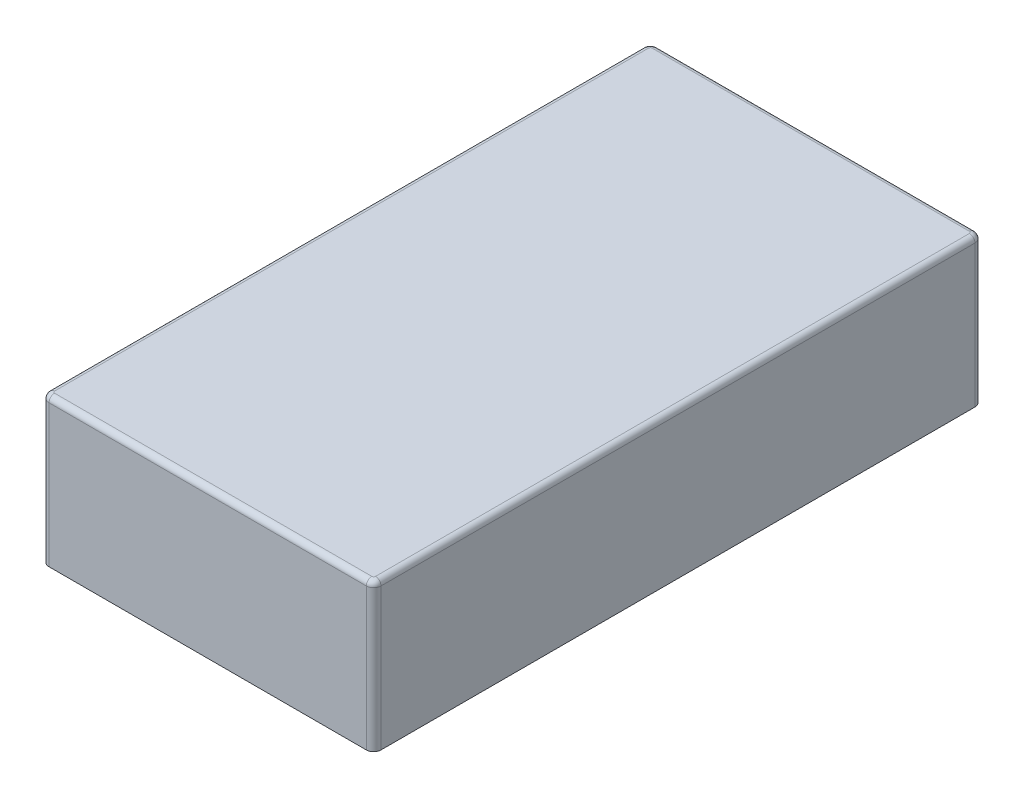
ISO-10303-21;
HEADER;
FILE_DESCRIPTION(('STEP AP214'),'2;1');
FILE_NAME('part.step','',(''),(''),'','','');
FILE_SCHEMA(('AUTOMOTIVE_DESIGN { 1 0 10303 214 1 1 1 1 }'));
ENDSEC;
DATA;
#1=APPLICATION_CONTEXT('core data for automotive mechanical design processes');
#2=APPLICATION_PROTOCOL_DEFINITION('international standard','automotive_design',2000,#1);
#3=PRODUCT_CONTEXT('',#1,'mechanical');
#4=PRODUCT('Part','Part','',(#3));
#5=PRODUCT_RELATED_PRODUCT_CATEGORY('part','',(#4));
#6=PRODUCT_DEFINITION_FORMATION('','',#4);
#7=PRODUCT_DEFINITION_CONTEXT('part definition',#1,'design');
#8=PRODUCT_DEFINITION('design','',#6,#7);
#9=PRODUCT_DEFINITION_SHAPE('','',#8);
#10=(LENGTH_UNIT() NAMED_UNIT(*) SI_UNIT(.MILLI.,.METRE.));
#11=(NAMED_UNIT(*) PLANE_ANGLE_UNIT() SI_UNIT($,.RADIAN.));
#12=(NAMED_UNIT(*) SI_UNIT($,.STERADIAN.) SOLID_ANGLE_UNIT());
#13=UNCERTAINTY_MEASURE_WITH_UNIT(LENGTH_MEASURE(1.E-05),#10,'distance_accuracy_value','');
#14=(GEOMETRIC_REPRESENTATION_CONTEXT(3) GLOBAL_UNCERTAINTY_ASSIGNED_CONTEXT((#13)) GLOBAL_UNIT_ASSIGNED_CONTEXT((#10,
#11,#12)) REPRESENTATION_CONTEXT('',''));
#15=CARTESIAN_POINT('',(0.,0.,0.));
#16=DIRECTION('',(0.,0.,1.));
#17=DIRECTION('',(1.,0.,0.));
#18=AXIS2_PLACEMENT_3D('',#15,#16,#17);
#19=CARTESIAN_POINT('',(0.,104.,0.));
#20=DIRECTION('',(0.,1.,0.));
#21=DIRECTION('',(0.,0.,1.));
#22=AXIS2_PLACEMENT_3D('',#19,#20,#21);
#23=PLANE('',#22);
#24=CARTESIAN_POINT('',(25.,104.,0.));
#25=DIRECTION('',(0.,-1.,0.));
#26=DIRECTION('',(0.,0.,-1.));
#27=AXIS2_PLACEMENT_3D('',#24,#25,#26);
#28=CIRCLE('',#27,3.2);
#29=CARTESIAN_POINT('',(25.,104.,-3.2));
#30=VERTEX_POINT('',#29);
#31=EDGE_CURVE('E522',#30,#30,#28,.T.);
#32=ORIENTED_EDGE('',*,*,#31,.F.);
#33=EDGE_LOOP('',(#32));
#34=FACE_BOUND('',#33,.T.);
#35=DIRECTION('',(0.,0.,-1.));
#36=VECTOR('',#35,1.);
#37=CARTESIAN_POINT('',(110.,104.,-77.9999925057749));
#38=LINE('',#37,#36);
#39=CARTESIAN_POINT('',(110.,104.,76.0000074942251));
#40=VERTEX_POINT('',#39);
#41=CARTESIAN_POINT('',(110.,104.,-75.9999925057749));
#42=VERTEX_POINT('',#41);
#43=EDGE_CURVE('E363',#40,#42,#38,.T.);
#44=ORIENTED_EDGE('',*,*,#43,.T.);
#45=CARTESIAN_POINT('',(108.,104.,-75.9999925057749));
#46=DIRECTION('',(0.,1.,0.));
#47=DIRECTION('',(0.,0.,1.));
#48=AXIS2_PLACEMENT_3D('',#45,#46,#47);
#49=CIRCLE('',#48,2.);
#50=CARTESIAN_POINT('',(108.,104.,-77.9999925057749));
#51=VERTEX_POINT('',#50);
#52=EDGE_CURVE('E360',#51,#42,#49,.F.);
#53=ORIENTED_EDGE('',*,*,#52,.F.);
#54=DIRECTION('',(-1.,0.,0.));
#55=VECTOR('',#54,1.);
#56=CARTESIAN_POINT('',(40.,104.,-77.9999925057749));
#57=LINE('',#56,#55);
#58=CARTESIAN_POINT('',(42.,104.,-77.9999925057749));
#59=VERTEX_POINT('',#58);
#60=EDGE_CURVE('E353',#51,#59,#57,.T.);
#61=ORIENTED_EDGE('',*,*,#60,.T.);
#62=CARTESIAN_POINT('',(42.,104.,-75.9999925057749));
#63=DIRECTION('',(0.,1.,0.));
#64=DIRECTION('',(0.,0.,1.));
#65=AXIS2_PLACEMENT_3D('',#62,#63,#64);
#66=CIRCLE('',#65,2.);
#67=CARTESIAN_POINT('',(40.,104.,-75.9999925057748));
#68=VERTEX_POINT('',#67);
#69=EDGE_CURVE('E427',#68,#59,#66,.F.);
#70=ORIENTED_EDGE('',*,*,#69,.F.);
#71=DIRECTION('',(0.,0.,1.));
#72=VECTOR('',#71,1.);
#73=CARTESIAN_POINT('',(40.0000000000004,104.,78.0000074942254));
#74=LINE('',#73,#72);
#75=CARTESIAN_POINT('',(40.0000000000004,104.,76.0000074942253));
#76=VERTEX_POINT('',#75);
#77=EDGE_CURVE('E355',#68,#76,#74,.T.);
#78=ORIENTED_EDGE('',*,*,#77,.T.);
#79=CARTESIAN_POINT('',(42.0000000000004,104.,76.0000074942253));
#80=DIRECTION('',(0.,1.,0.));
#81=DIRECTION('',(0.,0.,1.));
#82=AXIS2_PLACEMENT_3D('',#79,#80,#81);
#83=CIRCLE('',#82,2.);
#84=CARTESIAN_POINT('',(42.0000000000004,104.,78.0000074942254));
#85=VERTEX_POINT('',#84);
#86=EDGE_CURVE('E357',#85,#76,#83,.F.);
#87=ORIENTED_EDGE('',*,*,#86,.F.);
#88=DIRECTION('',(1.,0.,0.));
#89=VECTOR('',#88,1.);
#90=CARTESIAN_POINT('',(110.,104.,78.0000074942251));
#91=LINE('',#90,#89);
#92=CARTESIAN_POINT('',(108.,104.,78.0000074942251));
#93=VERTEX_POINT('',#92);
#94=EDGE_CURVE('E365',#85,#93,#91,.T.);
#95=ORIENTED_EDGE('',*,*,#94,.T.);
#96=CARTESIAN_POINT('',(108.,104.,76.0000074942251));
#97=DIRECTION('',(0.,1.,0.));
#98=DIRECTION('',(0.,0.,1.));
#99=AXIS2_PLACEMENT_3D('',#96,#97,#98);
#100=CIRCLE('',#99,2.);
#101=EDGE_CURVE('E325',#40,#93,#100,.F.);
#102=ORIENTED_EDGE('',*,*,#101,.F.);
#103=EDGE_LOOP('',(#44,#53,#61,#70,#78,#87,#95,#102));
#104=FACE_BOUND('',#103,.T.);
#105=DIRECTION('',(0.,0.,1.));
#106=VECTOR('',#105,1.);
#107=CARTESIAN_POINT('',(120.,104.,0.));
#108=LINE('',#107,#106);
#109=CARTESIAN_POINT('',(120.,104.,-80.5));
#110=VERTEX_POINT('',#109);
#111=CARTESIAN_POINT('',(120.,104.,80.5));
#112=VERTEX_POINT('',#111);
#113=EDGE_CURVE('E370',#110,#112,#108,.T.);
#114=ORIENTED_EDGE('',*,*,#113,.T.);
#115=CARTESIAN_POINT('',(118.,104.,80.5));
#116=DIRECTION('',(0.,1.,0.));
#117=DIRECTION('',(0.,0.,1.));
#118=AXIS2_PLACEMENT_3D('',#115,#116,#117);
#119=CIRCLE('',#118,2.);
#120=CARTESIAN_POINT('',(118.,104.,82.5));
#121=VERTEX_POINT('',#120);
#122=EDGE_CURVE('E375',#112,#121,#119,.F.);
#123=ORIENTED_EDGE('',*,*,#122,.T.);
#124=DIRECTION('',(1.,0.,0.));
#125=VECTOR('',#124,1.);
#126=CARTESIAN_POINT('',(-75.,104.,82.5));
#127=LINE('',#126,#125);
#128=CARTESIAN_POINT('',(32.,104.,82.5));
#129=VERTEX_POINT('',#128);
#130=EDGE_CURVE('E383',#129,#121,#127,.T.);
#131=ORIENTED_EDGE('',*,*,#130,.F.);
#132=CARTESIAN_POINT('',(32.,104.,80.5));
#133=DIRECTION('',(0.,1.,0.));
#134=DIRECTION('',(0.,0.,1.));
#135=AXIS2_PLACEMENT_3D('',#132,#133,#134);
#136=CIRCLE('',#135,2.);
#137=CARTESIAN_POINT('',(30.,104.,80.5));
#138=VERTEX_POINT('',#137);
#139=EDGE_CURVE('E386',#129,#138,#136,.F.);
#140=ORIENTED_EDGE('',*,*,#139,.T.);
#141=DIRECTION('',(0.,0.,1.));
#142=VECTOR('',#141,1.);
#143=CARTESIAN_POINT('',(30.,104.,82.5));
#144=LINE('',#143,#142);
#145=CARTESIAN_POINT('',(30.,104.,6.50000000000001));
#146=VERTEX_POINT('',#145);
#147=EDGE_CURVE('E379',#146,#138,#144,.T.);
#148=ORIENTED_EDGE('',*,*,#147,.F.);
#149=CARTESIAN_POINT('',(28.5,104.,6.50000000000001));
#150=DIRECTION('',(0.,1.,0.));
#151=DIRECTION('',(0.,0.,1.));
#152=AXIS2_PLACEMENT_3D('',#149,#150,#151);
#153=CIRCLE('',#152,1.5);
#154=CARTESIAN_POINT('',(28.5,104.,5.));
#155=VERTEX_POINT('',#154);
#156=EDGE_CURVE('E132',#146,#155,#153,.T.);
#157=ORIENTED_EDGE('',*,*,#156,.T.);
#158=DIRECTION('',(1.,0.,0.));
#159=VECTOR('',#158,1.);
#160=CARTESIAN_POINT('',(0.,104.,5.));
#161=LINE('',#160,#159);
#162=CARTESIAN_POINT('',(21.5,104.,5.));
#163=VERTEX_POINT('',#162);
#164=EDGE_CURVE('E696',#163,#155,#161,.T.);
#165=ORIENTED_EDGE('',*,*,#164,.F.);
#166=CARTESIAN_POINT('',(21.5,104.,3.5));
#167=DIRECTION('',(0.,1.,0.));
#168=DIRECTION('',(0.,0.,1.));
#169=AXIS2_PLACEMENT_3D('',#166,#167,#168);
#170=CIRCLE('',#169,1.5);
#171=CARTESIAN_POINT('',(20.,104.,3.5));
#172=VERTEX_POINT('',#171);
#173=EDGE_CURVE('E505',#163,#172,#170,.F.);
#174=ORIENTED_EDGE('',*,*,#173,.T.);
#175=DIRECTION('',(0.,0.,-1.));
#176=VECTOR('',#175,1.);
#177=CARTESIAN_POINT('',(20.,104.,0.));
#178=LINE('',#177,#176);
#179=CARTESIAN_POINT('',(20.,104.,-3.5));
#180=VERTEX_POINT('',#179);
#181=EDGE_CURVE('E693',#172,#180,#178,.T.);
#182=ORIENTED_EDGE('',*,*,#181,.T.);
#183=CARTESIAN_POINT('',(21.5,104.,-3.5));
#184=DIRECTION('',(0.,1.,0.));
#185=DIRECTION('',(0.,0.,1.));
#186=AXIS2_PLACEMENT_3D('',#183,#184,#185);
#187=CIRCLE('',#186,1.5);
#188=CARTESIAN_POINT('',(21.5,104.,-5.));
#189=VERTEX_POINT('',#188);
#190=EDGE_CURVE('E147',#180,#189,#187,.F.);
#191=ORIENTED_EDGE('',*,*,#190,.T.);
#192=DIRECTION('',(1.,0.,0.));
#193=VECTOR('',#192,1.);
#194=CARTESIAN_POINT('',(0.,104.,-5.));
#195=LINE('',#194,#193);
#196=CARTESIAN_POINT('',(28.5,104.,-5.));
#197=VERTEX_POINT('',#196);
#198=EDGE_CURVE('E695',#189,#197,#195,.T.);
#199=ORIENTED_EDGE('',*,*,#198,.T.);
#200=CARTESIAN_POINT('',(28.5,104.,-6.5));
#201=DIRECTION('',(0.,1.,0.));
#202=DIRECTION('',(0.,0.,1.));
#203=AXIS2_PLACEMENT_3D('',#200,#201,#202);
#204=CIRCLE('',#203,1.5);
#205=CARTESIAN_POINT('',(30.,104.,-6.49999999999999));
#206=VERTEX_POINT('',#205);
#207=EDGE_CURVE('E12',#197,#206,#204,.T.);
#208=ORIENTED_EDGE('',*,*,#207,.T.);
#209=CARTESIAN_POINT('',(30.,104.,-80.5));
#210=VERTEX_POINT('',#209);
#211=EDGE_CURVE('E380',#210,#206,#144,.T.);
#212=ORIENTED_EDGE('',*,*,#211,.F.);
#213=CARTESIAN_POINT('',(32.,104.,-80.5));
#214=DIRECTION('',(0.,1.,0.));
#215=DIRECTION('',(0.,0.,1.));
#216=AXIS2_PLACEMENT_3D('',#213,#214,#215);
#217=CIRCLE('',#216,2.);
#218=CARTESIAN_POINT('',(32.,104.,-82.5));
#219=VERTEX_POINT('',#218);
#220=EDGE_CURVE('E377',#210,#219,#217,.F.);
#221=ORIENTED_EDGE('',*,*,#220,.T.);
#222=DIRECTION('',(-1.,0.,0.));
#223=VECTOR('',#222,1.);
#224=CARTESIAN_POINT('',(-75.,104.,-82.5));
#225=LINE('',#224,#223);
#226=CARTESIAN_POINT('',(118.,104.,-82.5));
#227=VERTEX_POINT('',#226);
#228=EDGE_CURVE('E372',#227,#219,#225,.T.);
#229=ORIENTED_EDGE('',*,*,#228,.F.);
#230=CARTESIAN_POINT('',(118.,104.,-80.5));
#231=DIRECTION('',(0.,1.,0.));
#232=DIRECTION('',(0.,0.,1.));
#233=AXIS2_PLACEMENT_3D('',#230,#231,#232);
#234=CIRCLE('',#233,2.);
#235=EDGE_CURVE('E368',#227,#110,#234,.F.);
#236=ORIENTED_EDGE('',*,*,#235,.T.);
#237=EDGE_LOOP('',(#114,#123,#131,#140,#148,#157,#165,#174,#182,#191,#199,#208,#212,#221,#229,#236));
#238=FACE_BOUND('',#237,.T.);
#239=ADVANCED_FACE('F123',(#34,#104,#238),#23,.F.);
#240=CARTESIAN_POINT('',(30.,107.,82.5));
#241=DIRECTION('',(1.,0.,0.));
#242=DIRECTION('',(0.,0.,-1.));
#243=AXIS2_PLACEMENT_3D('',#240,#241,#242);
#244=PLANE('',#243);
#245=CARTESIAN_POINT('',(30.,131.307025548532,0.));
#246=DIRECTION('',(-1.,0.,0.));
#247=DIRECTION('',(0.,0.,1.));
#248=AXIS2_PLACEMENT_3D('',#245,#246,#247);
#249=ELLIPSE('',#248,10.5630271411605,4.77851227814405);
#250=CARTESIAN_POINT('',(30.,131.307025548532,10.5630271411605));
#251=VERTEX_POINT('',#250);
#252=EDGE_CURVE('E524',#251,#251,#249,.T.);
#253=ORIENTED_EDGE('',*,*,#252,.F.);
#254=EDGE_LOOP('',(#253));
#255=FACE_BOUND('',#254,.T.);
#256=DIRECTION('',(0.,0.,-1.));
#257=VECTOR('',#256,1.);
#258=CARTESIAN_POINT('',(30.,110.5,5.));
#259=LINE('',#258,#257);
#260=CARTESIAN_POINT('',(30.,110.5,-6.5));
#261=VERTEX_POINT('',#260);
#262=CARTESIAN_POINT('',(30.,110.5,6.50000000000001));
#263=VERTEX_POINT('',#262);
#264=EDGE_CURVE('E495',#261,#263,#259,.F.);
#265=ORIENTED_EDGE('',*,*,#264,.T.);
#266=DIRECTION('',(0.,-1.,0.));
#267=VECTOR('',#266,1.);
#268=CARTESIAN_POINT('',(30.,104.,6.50000000000001));
#269=LINE('',#268,#267);
#270=EDGE_CURVE('E497',#263,#146,#269,.T.);
#271=ORIENTED_EDGE('',*,*,#270,.T.);
#272=ORIENTED_EDGE('',*,*,#147,.T.);
#273=DIRECTION('',(0.,-1.,0.));
#274=VECTOR('',#273,1.);
#275=CARTESIAN_POINT('',(30.,107.,80.5));
#276=LINE('',#275,#274);
#277=CARTESIAN_POINT('',(30.,142.5,80.5));
#278=VERTEX_POINT('',#277);
#279=EDGE_CURVE('E389',#138,#278,#276,.F.);
#280=ORIENTED_EDGE('',*,*,#279,.T.);
#281=DIRECTION('',(0.,0.,1.));
#282=VECTOR('',#281,1.);
#283=CARTESIAN_POINT('',(30.,142.5,-80.5));
#284=LINE('',#283,#282);
#285=CARTESIAN_POINT('',(30.,142.5,-80.5));
#286=VERTEX_POINT('',#285);
#287=EDGE_CURVE('E447',#278,#286,#284,.F.);
#288=ORIENTED_EDGE('',*,*,#287,.T.);
#289=DIRECTION('',(0.,-1.,0.));
#290=VECTOR('',#289,1.);
#291=CARTESIAN_POINT('',(30.,107.,-80.5));
#292=LINE('',#291,#290);
#293=EDGE_CURVE('E392',#286,#210,#292,.T.);
#294=ORIENTED_EDGE('',*,*,#293,.T.);
#295=ORIENTED_EDGE('',*,*,#211,.T.);
#296=DIRECTION('',(0.,-1.,0.));
#297=VECTOR('',#296,1.);
#298=CARTESIAN_POINT('',(30.,107.,-6.49999999999999));
#299=LINE('',#298,#297);
#300=EDGE_CURVE('E493',#206,#261,#299,.F.);
#301=ORIENTED_EDGE('',*,*,#300,.T.);
#302=EDGE_LOOP('',(#265,#271,#272,#280,#288,#294,#295,#301));
#303=FACE_BOUND('',#302,.T.);
#304=ADVANCED_FACE('F568',(#255,#303),#244,.F.);
#305=CARTESIAN_POINT('',(-75.,12.,82.5));
#306=DIRECTION('',(0.,0.,-1.));
#307=DIRECTION('',(-1.,0.,0.));
#308=AXIS2_PLACEMENT_3D('',#305,#306,#307);
#309=PLANE('',#308);
#310=DIRECTION('',(0.,1.,0.));
#311=VECTOR('',#310,1.);
#312=CARTESIAN_POINT('',(118.,107.,82.5));
#313=LINE('',#312,#311);
#314=CARTESIAN_POINT('',(118.,142.5,82.5));
#315=VERTEX_POINT('',#314);
#316=EDGE_CURVE('E399',#121,#315,#313,.T.);
#317=ORIENTED_EDGE('',*,*,#316,.T.);
#318=DIRECTION('',(1.,0.,0.));
#319=VECTOR('',#318,1.);
#320=CARTESIAN_POINT('',(32.,142.5,82.5));
#321=LINE('',#320,#319);
#322=CARTESIAN_POINT('',(32.,142.5,82.5));
#323=VERTEX_POINT('',#322);
#324=EDGE_CURVE('E460',#315,#323,#321,.F.);
#325=ORIENTED_EDGE('',*,*,#324,.T.);
#326=DIRECTION('',(0.,-1.,0.));
#327=VECTOR('',#326,1.);
#328=CARTESIAN_POINT('',(32.,12.,82.5));
#329=LINE('',#328,#327);
#330=EDGE_CURVE('E397',#323,#129,#329,.T.);
#331=ORIENTED_EDGE('',*,*,#330,.T.);
#332=ORIENTED_EDGE('',*,*,#130,.T.);
#333=EDGE_LOOP('',(#317,#325,#331,#332));
#334=FACE_BOUND('',#333,.T.);
#335=ADVANCED_FACE('F587',(#334),#309,.F.);
#336=CARTESIAN_POINT('',(-75.,12.,-82.5));
#337=DIRECTION('',(0.,0.,1.));
#338=DIRECTION('',(1.,0.,0.));
#339=AXIS2_PLACEMENT_3D('',#336,#337,#338);
#340=PLANE('',#339);
#341=DIRECTION('',(0.,-1.,0.));
#342=VECTOR('',#341,1.);
#343=CARTESIAN_POINT('',(32.,12.,-82.5));
#344=LINE('',#343,#342);
#345=CARTESIAN_POINT('',(32.,142.5,-82.5));
#346=VERTEX_POINT('',#345);
#347=EDGE_CURVE('E394',#219,#346,#344,.F.);
#348=ORIENTED_EDGE('',*,*,#347,.T.);
#349=DIRECTION('',(-1.,0.,0.));
#350=VECTOR('',#349,1.);
#351=CARTESIAN_POINT('',(118.,142.5,-82.5));
#352=LINE('',#351,#350);
#353=CARTESIAN_POINT('',(118.,142.5,-82.5));
#354=VERTEX_POINT('',#353);
#355=EDGE_CURVE('E452',#346,#354,#352,.F.);
#356=ORIENTED_EDGE('',*,*,#355,.T.);
#357=DIRECTION('',(0.,1.,0.));
#358=VECTOR('',#357,1.);
#359=CARTESIAN_POINT('',(118.,0.,-82.5));
#360=LINE('',#359,#358);
#361=EDGE_CURVE('E408',#354,#227,#360,.F.);
#362=ORIENTED_EDGE('',*,*,#361,.T.);
#363=ORIENTED_EDGE('',*,*,#228,.T.);
#364=EDGE_LOOP('',(#348,#356,#362,#363));
#365=FACE_BOUND('',#364,.T.);
#366=ADVANCED_FACE('F591',(#365),#340,.F.);
#367=CARTESIAN_POINT('',(120.,-171.026313764871,0.));
#368=DIRECTION('',(1.,0.,0.));
#369=DIRECTION('',(0.,0.,-1.));
#370=AXIS2_PLACEMENT_3D('',#367,#368,#369);
#371=PLANE('',#370);
#372=DIRECTION('',(0.,1.,0.));
#373=VECTOR('',#372,1.);
#374=CARTESIAN_POINT('',(120.,0.,80.5));
#375=LINE('',#374,#373);
#376=CARTESIAN_POINT('',(120.,142.5,80.5));
#377=VERTEX_POINT('',#376);
#378=EDGE_CURVE('E405',#377,#112,#375,.F.);
#379=ORIENTED_EDGE('',*,*,#378,.T.);
#380=ORIENTED_EDGE('',*,*,#113,.F.);
#381=DIRECTION('',(0.,1.,0.));
#382=VECTOR('',#381,1.);
#383=CARTESIAN_POINT('',(120.,107.,-80.5));
#384=LINE('',#383,#382);
#385=CARTESIAN_POINT('',(120.,142.5,-80.5));
#386=VERTEX_POINT('',#385);
#387=EDGE_CURVE('E402',#110,#386,#384,.T.);
#388=ORIENTED_EDGE('',*,*,#387,.T.);
#389=DIRECTION('',(0.,0.,-1.));
#390=VECTOR('',#389,1.);
#391=CARTESIAN_POINT('',(120.,142.5,0.));
#392=LINE('',#391,#390);
#393=EDGE_CURVE('E456',#386,#377,#392,.F.);
#394=ORIENTED_EDGE('',*,*,#393,.T.);
#395=EDGE_LOOP('',(#379,#380,#388,#394));
#396=FACE_BOUND('',#395,.T.);
#397=ADVANCED_FACE('F584',(#396),#371,.T.);
#398=CARTESIAN_POINT('',(40.0000000000004,107.,78.0000074942254));
#399=DIRECTION('',(1.,0.,0.));
#400=DIRECTION('',(0.,0.,-1.));
#401=AXIS2_PLACEMENT_3D('',#398,#399,#400);
#402=PLANE('',#401);
#403=CARTESIAN_POINT('',(40.,131.307025548532,0.));
#404=DIRECTION('',(-1.,0.,0.));
#405=DIRECTION('',(0.,0.,1.));
#406=AXIS2_PLACEMENT_3D('',#403,#404,#405);
#407=ELLIPSE('',#406,10.5630271411605,4.77851227814405);
#408=CARTESIAN_POINT('',(40.,131.307025548532,10.5630271411605));
#409=VERTEX_POINT('',#408);
#410=EDGE_CURVE('E516',#409,#409,#407,.T.);
#411=ORIENTED_EDGE('',*,*,#410,.T.);
#412=EDGE_LOOP('',(#411));
#413=FACE_BOUND('',#412,.T.);
#414=ORIENTED_EDGE('',*,*,#77,.F.);
#415=DIRECTION('',(0.,-1.,0.));
#416=VECTOR('',#415,1.);
#417=CARTESIAN_POINT('',(40.,107.,-75.9999925057749));
#418=LINE('',#417,#416);
#419=CARTESIAN_POINT('',(40.,139.,-75.9999925057748));
#420=VERTEX_POINT('',#419);
#421=EDGE_CURVE('E421',#68,#420,#418,.F.);
#422=ORIENTED_EDGE('',*,*,#421,.T.);
#423=DIRECTION('',(0.,0.,1.));
#424=VECTOR('',#423,1.);
#425=CARTESIAN_POINT('',(40.,139.,-75.9999925057748));
#426=LINE('',#425,#424);
#427=CARTESIAN_POINT('',(40.0000000000004,139.,76.0000074942253));
#428=VERTEX_POINT('',#427);
#429=EDGE_CURVE('E350',#420,#428,#426,.T.);
#430=ORIENTED_EDGE('',*,*,#429,.T.);
#431=DIRECTION('',(0.,-1.,0.));
#432=VECTOR('',#431,1.);
#433=CARTESIAN_POINT('',(40.0000000000004,12.,76.0000074942253));
#434=LINE('',#433,#432);
#435=EDGE_CURVE('E424',#428,#76,#434,.T.);
#436=ORIENTED_EDGE('',*,*,#435,.T.);
#437=EDGE_LOOP('',(#414,#422,#430,#436));
#438=FACE_BOUND('',#437,.T.);
#439=ADVANCED_FACE('F581',(#413,#438),#402,.T.);
#440=CARTESIAN_POINT('',(110.,107.,78.0000074942251));
#441=DIRECTION('',(0.,0.,-1.));
#442=DIRECTION('',(-1.,0.,0.));
#443=AXIS2_PLACEMENT_3D('',#440,#441,#442);
#444=PLANE('',#443);
#445=ORIENTED_EDGE('',*,*,#94,.F.);
#446=DIRECTION('',(0.,-1.,0.));
#447=VECTOR('',#446,1.);
#448=CARTESIAN_POINT('',(42.0000000000004,107.,78.0000074942254));
#449=LINE('',#448,#447);
#450=CARTESIAN_POINT('',(42.0000000000004,139.,78.0000074942254));
#451=VERTEX_POINT('',#450);
#452=EDGE_CURVE('E329',#85,#451,#449,.F.);
#453=ORIENTED_EDGE('',*,*,#452,.T.);
#454=DIRECTION('',(1.,0.,0.));
#455=VECTOR('',#454,1.);
#456=CARTESIAN_POINT('',(42.0000000000004,139.,78.0000074942254));
#457=LINE('',#456,#455);
#458=CARTESIAN_POINT('',(108.,139.,78.0000074942251));
#459=VERTEX_POINT('',#458);
#460=EDGE_CURVE('E313',#451,#459,#457,.T.);
#461=ORIENTED_EDGE('',*,*,#460,.T.);
#462=DIRECTION('',(0.,-1.,0.));
#463=VECTOR('',#462,1.);
#464=CARTESIAN_POINT('',(108.,12.,78.0000074942251));
#465=LINE('',#464,#463);
#466=EDGE_CURVE('E323',#459,#93,#465,.T.);
#467=ORIENTED_EDGE('',*,*,#466,.T.);
#468=EDGE_LOOP('',(#445,#453,#461,#467));
#469=FACE_BOUND('',#468,.T.);
#470=ADVANCED_FACE('F331',(#469),#444,.T.);
#471=CARTESIAN_POINT('',(110.,107.,-77.9999925057749));
#472=DIRECTION('',(-1.,0.,0.));
#473=DIRECTION('',(0.,0.,1.));
#474=AXIS2_PLACEMENT_3D('',#471,#472,#473);
#475=PLANE('',#474);
#476=ORIENTED_EDGE('',*,*,#43,.F.);
#477=DIRECTION('',(0.,-1.,0.));
#478=VECTOR('',#477,1.);
#479=CARTESIAN_POINT('',(110.,107.,76.0000074942251));
#480=LINE('',#479,#478);
#481=CARTESIAN_POINT('',(110.,139.,76.0000074942251));
#482=VERTEX_POINT('',#481);
#483=EDGE_CURVE('E413',#40,#482,#480,.F.);
#484=ORIENTED_EDGE('',*,*,#483,.T.);
#485=DIRECTION('',(0.,0.,-1.));
#486=VECTOR('',#485,1.);
#487=CARTESIAN_POINT('',(110.,139.,76.0000074942251));
#488=LINE('',#487,#486);
#489=CARTESIAN_POINT('',(110.,139.,-75.9999925057749));
#490=VERTEX_POINT('',#489);
#491=EDGE_CURVE('E316',#482,#490,#488,.T.);
#492=ORIENTED_EDGE('',*,*,#491,.T.);
#493=DIRECTION('',(0.,-1.,0.));
#494=VECTOR('',#493,1.);
#495=CARTESIAN_POINT('',(110.,12.,-75.9999925057749));
#496=LINE('',#495,#494);
#497=EDGE_CURVE('E328',#490,#42,#496,.T.);
#498=ORIENTED_EDGE('',*,*,#497,.T.);
#499=EDGE_LOOP('',(#476,#484,#492,#498));
#500=FACE_BOUND('',#499,.T.);
#501=ADVANCED_FACE('F574',(#500),#475,.T.);
#502=CARTESIAN_POINT('',(40.,107.,-77.9999925057749));
#503=DIRECTION('',(0.,0.,1.));
#504=DIRECTION('',(1.,0.,0.));
#505=AXIS2_PLACEMENT_3D('',#502,#503,#504);
#506=PLANE('',#505);
#507=ORIENTED_EDGE('',*,*,#60,.F.);
#508=DIRECTION('',(0.,-1.,0.));
#509=VECTOR('',#508,1.);
#510=CARTESIAN_POINT('',(108.,107.,-77.9999925057749));
#511=LINE('',#510,#509);
#512=CARTESIAN_POINT('',(108.,139.,-77.9999925057749));
#513=VERTEX_POINT('',#512);
#514=EDGE_CURVE('E418',#51,#513,#511,.F.);
#515=ORIENTED_EDGE('',*,*,#514,.T.);
#516=DIRECTION('',(-1.,0.,0.));
#517=VECTOR('',#516,1.);
#518=CARTESIAN_POINT('',(108.,139.,-77.9999925057749));
#519=LINE('',#518,#517);
#520=CARTESIAN_POINT('',(42.,139.,-77.9999925057749));
#521=VERTEX_POINT('',#520);
#522=EDGE_CURVE('E344',#513,#521,#519,.T.);
#523=ORIENTED_EDGE('',*,*,#522,.T.);
#524=DIRECTION('',(0.,-1.,0.));
#525=VECTOR('',#524,1.);
#526=CARTESIAN_POINT('',(42.,12.,-77.9999925057749));
#527=LINE('',#526,#525);
#528=EDGE_CURVE('E415',#521,#59,#527,.T.);
#529=ORIENTED_EDGE('',*,*,#528,.T.);
#530=EDGE_LOOP('',(#507,#515,#523,#529));
#531=FACE_BOUND('',#530,.T.);
#532=ADVANCED_FACE('F570',(#531),#506,.T.);
#533=CARTESIAN_POINT('',(32.,12.,80.5));
#534=DIRECTION('',(0.,-1.,0.));
#535=DIRECTION('',(0.,0.,-1.));
#536=AXIS2_PLACEMENT_3D('',#533,#534,#535);
#537=CYLINDRICAL_SURFACE('',#536,2.);
#538=ORIENTED_EDGE('',*,*,#330,.F.);
#539=CARTESIAN_POINT('',(32.,142.5,80.5));
#540=DIRECTION('',(0.,1.,0.));
#541=DIRECTION('',(0.,0.,1.));
#542=AXIS2_PLACEMENT_3D('',#539,#540,#541);
#543=CIRCLE('',#542,2.);
#544=EDGE_CURVE('E462',#323,#278,#543,.F.);
#545=ORIENTED_EDGE('',*,*,#544,.T.);
#546=ORIENTED_EDGE('',*,*,#279,.F.);
#547=ORIENTED_EDGE('',*,*,#139,.F.);
#548=EDGE_LOOP('',(#538,#545,#546,#547));
#549=FACE_BOUND('',#548,.T.);
#550=ADVANCED_FACE('F573',(#549),#537,.T.);
#551=CARTESIAN_POINT('',(32.,107.,-80.5));
#552=DIRECTION('',(0.,-1.,0.));
#553=DIRECTION('',(0.,0.,-1.));
#554=AXIS2_PLACEMENT_3D('',#551,#552,#553);
#555=CYLINDRICAL_SURFACE('',#554,2.);
#556=ORIENTED_EDGE('',*,*,#293,.F.);
#557=CARTESIAN_POINT('',(32.,142.5,-80.5));
#558=DIRECTION('',(0.,1.,0.));
#559=DIRECTION('',(0.,0.,1.));
#560=AXIS2_PLACEMENT_3D('',#557,#558,#559);
#561=CIRCLE('',#560,2.);
#562=EDGE_CURVE('E450',#286,#346,#561,.F.);
#563=ORIENTED_EDGE('',*,*,#562,.T.);
#564=ORIENTED_EDGE('',*,*,#347,.F.);
#565=ORIENTED_EDGE('',*,*,#220,.F.);
#566=EDGE_LOOP('',(#556,#563,#564,#565));
#567=FACE_BOUND('',#566,.T.);
#568=ADVANCED_FACE('F599',(#567),#555,.T.);
#569=CARTESIAN_POINT('',(118.,12.,80.5));
#570=DIRECTION('',(0.,-1.,0.));
#571=DIRECTION('',(0.,0.,-1.));
#572=AXIS2_PLACEMENT_3D('',#569,#570,#571);
#573=CYLINDRICAL_SURFACE('',#572,2.);
#574=ORIENTED_EDGE('',*,*,#378,.F.);
#575=CARTESIAN_POINT('',(118.,142.5,80.5));
#576=DIRECTION('',(0.,1.,0.));
#577=DIRECTION('',(0.,0.,1.));
#578=AXIS2_PLACEMENT_3D('',#575,#576,#577);
#579=CIRCLE('',#578,2.);
#580=EDGE_CURVE('E458',#377,#315,#579,.F.);
#581=ORIENTED_EDGE('',*,*,#580,.T.);
#582=ORIENTED_EDGE('',*,*,#316,.F.);
#583=ORIENTED_EDGE('',*,*,#122,.F.);
#584=EDGE_LOOP('',(#574,#581,#582,#583));
#585=FACE_BOUND('',#584,.T.);
#586=ADVANCED_FACE('F602',(#585),#573,.T.);
#587=CARTESIAN_POINT('',(118.,-171.026313764871,-80.5));
#588=DIRECTION('',(0.,-1.,0.));
#589=DIRECTION('',(0.,0.,-1.));
#590=AXIS2_PLACEMENT_3D('',#587,#588,#589);
#591=CYLINDRICAL_SURFACE('',#590,2.);
#592=ORIENTED_EDGE('',*,*,#361,.F.);
#593=CARTESIAN_POINT('',(118.,142.5,-80.5));
#594=DIRECTION('',(0.,1.,0.));
#595=DIRECTION('',(0.,0.,1.));
#596=AXIS2_PLACEMENT_3D('',#593,#594,#595);
#597=CIRCLE('',#596,2.);
#598=EDGE_CURVE('E454',#354,#386,#597,.F.);
#599=ORIENTED_EDGE('',*,*,#598,.T.);
#600=ORIENTED_EDGE('',*,*,#387,.F.);
#601=ORIENTED_EDGE('',*,*,#235,.F.);
#602=EDGE_LOOP('',(#592,#599,#600,#601));
#603=FACE_BOUND('',#602,.T.);
#604=ADVANCED_FACE('F609',(#603),#591,.T.);
#605=CARTESIAN_POINT('',(108.,107.,76.0000074942251));
#606=DIRECTION('',(0.,1.,0.));
#607=DIRECTION('',(0.,0.,1.));
#608=AXIS2_PLACEMENT_3D('',#605,#606,#607);
#609=CYLINDRICAL_SURFACE('',#608,2.);
#610=ORIENTED_EDGE('',*,*,#483,.F.);
#611=ORIENTED_EDGE('',*,*,#101,.T.);
#612=ORIENTED_EDGE('',*,*,#466,.F.);
#613=CARTESIAN_POINT('',(108.,139.,76.0000074942251));
#614=DIRECTION('',(0.,1.,0.));
#615=DIRECTION('',(0.,0.,1.));
#616=AXIS2_PLACEMENT_3D('',#613,#614,#615);
#617=CIRCLE('',#616,2.);
#618=EDGE_CURVE('E309',#459,#482,#617,.T.);
#619=ORIENTED_EDGE('',*,*,#618,.T.);
#620=EDGE_LOOP('',(#610,#611,#612,#619));
#621=FACE_BOUND('',#620,.T.);
#622=ADVANCED_FACE('F324',(#621),#609,.F.);
#623=CARTESIAN_POINT('',(108.,107.,-75.9999925057749));
#624=DIRECTION('',(0.,1.,0.));
#625=DIRECTION('',(0.,0.,1.));
#626=AXIS2_PLACEMENT_3D('',#623,#624,#625);
#627=CYLINDRICAL_SURFACE('',#626,2.);
#628=ORIENTED_EDGE('',*,*,#514,.F.);
#629=ORIENTED_EDGE('',*,*,#52,.T.);
#630=ORIENTED_EDGE('',*,*,#497,.F.);
#631=CARTESIAN_POINT('',(108.,139.,-75.9999925057749));
#632=DIRECTION('',(0.,1.,0.));
#633=DIRECTION('',(0.,0.,1.));
#634=AXIS2_PLACEMENT_3D('',#631,#632,#633);
#635=CIRCLE('',#634,2.);
#636=EDGE_CURVE('E341',#490,#513,#635,.T.);
#637=ORIENTED_EDGE('',*,*,#636,.T.);
#638=EDGE_LOOP('',(#628,#629,#630,#637));
#639=FACE_BOUND('',#638,.T.);
#640=ADVANCED_FACE('F616',(#639),#627,.F.);
#641=CARTESIAN_POINT('',(42.0000000000004,107.,76.0000074942253));
#642=DIRECTION('',(0.,1.,0.));
#643=DIRECTION('',(0.,0.,1.));
#644=AXIS2_PLACEMENT_3D('',#641,#642,#643);
#645=CYLINDRICAL_SURFACE('',#644,2.);
#646=ORIENTED_EDGE('',*,*,#452,.F.);
#647=ORIENTED_EDGE('',*,*,#86,.T.);
#648=ORIENTED_EDGE('',*,*,#435,.F.);
#649=CARTESIAN_POINT('',(42.0000000000004,139.,76.0000074942253));
#650=DIRECTION('',(0.,1.,0.));
#651=DIRECTION('',(0.,0.,1.));
#652=AXIS2_PLACEMENT_3D('',#649,#650,#651);
#653=CIRCLE('',#652,2.);
#654=EDGE_CURVE('E334',#428,#451,#653,.T.);
#655=ORIENTED_EDGE('',*,*,#654,.T.);
#656=EDGE_LOOP('',(#646,#647,#648,#655));
#657=FACE_BOUND('',#656,.T.);
#658=ADVANCED_FACE('F619',(#657),#645,.F.);
#659=CARTESIAN_POINT('',(42.,107.,-75.9999925057749));
#660=DIRECTION('',(0.,1.,0.));
#661=DIRECTION('',(0.,0.,1.));
#662=AXIS2_PLACEMENT_3D('',#659,#660,#661);
#663=CYLINDRICAL_SURFACE('',#662,2.);
#664=ORIENTED_EDGE('',*,*,#421,.F.);
#665=ORIENTED_EDGE('',*,*,#69,.T.);
#666=ORIENTED_EDGE('',*,*,#528,.F.);
#667=CARTESIAN_POINT('',(42.,139.,-75.9999925057749));
#668=DIRECTION('',(0.,1.,0.));
#669=DIRECTION('',(0.,0.,1.));
#670=AXIS2_PLACEMENT_3D('',#667,#668,#669);
#671=CIRCLE('',#670,2.);
#672=EDGE_CURVE('E347',#521,#420,#671,.T.);
#673=ORIENTED_EDGE('',*,*,#672,.T.);
#674=EDGE_LOOP('',(#664,#665,#666,#673));
#675=FACE_BOUND('',#674,.T.);
#676=ADVANCED_FACE('F565',(#675),#663,.F.);
#677=CARTESIAN_POINT('',(32.,139.,80.5));
#678=DIRECTION('',(0.,1.,0.));
#679=DIRECTION('',(0.,0.,1.));
#680=AXIS2_PLACEMENT_3D('',#677,#678,#679);
#681=PLANE('',#680);
#682=ORIENTED_EDGE('',*,*,#460,.F.);
#683=ORIENTED_EDGE('',*,*,#654,.F.);
#684=ORIENTED_EDGE('',*,*,#429,.F.);
#685=ORIENTED_EDGE('',*,*,#672,.F.);
#686=ORIENTED_EDGE('',*,*,#522,.F.);
#687=ORIENTED_EDGE('',*,*,#636,.F.);
#688=ORIENTED_EDGE('',*,*,#491,.F.);
#689=ORIENTED_EDGE('',*,*,#618,.F.);
#690=EDGE_LOOP('',(#682,#683,#684,#685,#686,#687,#688,#689));
#691=FACE_BOUND('',#690,.T.);
#692=ADVANCED_FACE('F311',(#691),#681,.F.);
#693=CARTESIAN_POINT('',(32.,144.,80.5));
#694=DIRECTION('',(0.,1.,0.));
#695=DIRECTION('',(0.,0.,1.));
#696=AXIS2_PLACEMENT_3D('',#693,#694,#695);
#697=PLANE('',#696);
#698=CARTESIAN_POINT('',(32.,144.,-80.5));
#699=DIRECTION('',(0.,1.,0.));
#700=DIRECTION('',(0.,0.,1.));
#701=AXIS2_PLACEMENT_3D('',#698,#699,#700);
#702=CIRCLE('',#701,0.5);
#703=CARTESIAN_POINT('',(32.,144.,-81.));
#704=VERTEX_POINT('',#703);
#705=CARTESIAN_POINT('',(31.5,144.,-80.5));
#706=VERTEX_POINT('',#705);
#707=EDGE_CURVE('E442',#704,#706,#702,.T.);
#708=ORIENTED_EDGE('',*,*,#707,.T.);
#709=DIRECTION('',(0.,0.,1.));
#710=VECTOR('',#709,1.);
#711=CARTESIAN_POINT('',(31.5,144.,80.5));
#712=LINE('',#711,#710);
#713=CARTESIAN_POINT('',(31.5,144.,80.5));
#714=VERTEX_POINT('',#713);
#715=EDGE_CURVE('E444',#706,#714,#712,.T.);
#716=ORIENTED_EDGE('',*,*,#715,.T.);
#717=CARTESIAN_POINT('',(32.,144.,80.5));
#718=DIRECTION('',(0.,1.,0.));
#719=DIRECTION('',(0.,0.,1.));
#720=AXIS2_PLACEMENT_3D('',#717,#718,#719);
#721=CIRCLE('',#720,0.5);
#722=CARTESIAN_POINT('',(32.,144.,81.));
#723=VERTEX_POINT('',#722);
#724=EDGE_CURVE('E430',#714,#723,#721,.T.);
#725=ORIENTED_EDGE('',*,*,#724,.T.);
#726=DIRECTION('',(1.,0.,0.));
#727=VECTOR('',#726,1.);
#728=CARTESIAN_POINT('',(118.,144.,81.));
#729=LINE('',#728,#727);
#730=CARTESIAN_POINT('',(118.,144.,81.));
#731=VERTEX_POINT('',#730);
#732=EDGE_CURVE('E432',#723,#731,#729,.T.);
#733=ORIENTED_EDGE('',*,*,#732,.T.);
#734=CARTESIAN_POINT('',(118.,144.,80.5));
#735=DIRECTION('',(0.,1.,0.));
#736=DIRECTION('',(0.,0.,1.));
#737=AXIS2_PLACEMENT_3D('',#734,#735,#736);
#738=CIRCLE('',#737,0.5);
#739=CARTESIAN_POINT('',(118.5,144.,80.5));
#740=VERTEX_POINT('',#739);
#741=EDGE_CURVE('E434',#731,#740,#738,.T.);
#742=ORIENTED_EDGE('',*,*,#741,.T.);
#743=DIRECTION('',(0.,0.,-1.));
#744=VECTOR('',#743,1.);
#745=CARTESIAN_POINT('',(118.5,144.,80.5));
#746=LINE('',#745,#744);
#747=CARTESIAN_POINT('',(118.5,144.,-80.5));
#748=VERTEX_POINT('',#747);
#749=EDGE_CURVE('E436',#740,#748,#746,.T.);
#750=ORIENTED_EDGE('',*,*,#749,.T.);
#751=CARTESIAN_POINT('',(118.,144.,-80.5));
#752=DIRECTION('',(0.,1.,0.));
#753=DIRECTION('',(0.,0.,1.));
#754=AXIS2_PLACEMENT_3D('',#751,#752,#753);
#755=CIRCLE('',#754,0.5);
#756=CARTESIAN_POINT('',(118.,144.,-81.));
#757=VERTEX_POINT('',#756);
#758=EDGE_CURVE('E438',#748,#757,#755,.T.);
#759=ORIENTED_EDGE('',*,*,#758,.T.);
#760=DIRECTION('',(-1.,0.,0.));
#761=VECTOR('',#760,1.);
#762=CARTESIAN_POINT('',(32.,144.,-81.));
#763=LINE('',#762,#761);
#764=EDGE_CURVE('E440',#757,#704,#763,.T.);
#765=ORIENTED_EDGE('',*,*,#764,.T.);
#766=EDGE_LOOP('',(#708,#716,#725,#733,#742,#750,#759,#765));
#767=FACE_BOUND('',#766,.T.);
#768=ADVANCED_FACE('F558',(#767),#697,.T.);
#769=CARTESIAN_POINT('',(118.5,142.5,80.5));
#770=DIRECTION('',(0.,0.,-1.));
#771=DIRECTION('',(-1.,0.,0.));
#772=AXIS2_PLACEMENT_3D('',#769,#770,#771);
#773=CYLINDRICAL_SURFACE('',#772,1.5);
#774=CARTESIAN_POINT('',(118.5,142.5,80.5));
#775=DIRECTION('',(0.,0.,1.));
#776=DIRECTION('',(1.,0.,0.));
#777=AXIS2_PLACEMENT_3D('',#774,#775,#776);
#778=CIRCLE('',#777,1.5);
#779=EDGE_CURVE('E482',#377,#740,#778,.T.);
#780=ORIENTED_EDGE('',*,*,#779,.F.);
#781=ORIENTED_EDGE('',*,*,#393,.F.);
#782=CARTESIAN_POINT('',(118.5,142.5,-80.5));
#783=DIRECTION('',(0.,0.,-1.));
#784=DIRECTION('',(-1.,0.,0.));
#785=AXIS2_PLACEMENT_3D('',#782,#783,#784);
#786=CIRCLE('',#785,1.5);
#787=EDGE_CURVE('E336',#748,#386,#786,.T.);
#788=ORIENTED_EDGE('',*,*,#787,.F.);
#789=ORIENTED_EDGE('',*,*,#749,.F.);
#790=EDGE_LOOP('',(#780,#781,#788,#789));
#791=FACE_BOUND('',#790,.T.);
#792=ADVANCED_FACE('F561',(#791),#773,.T.);
#793=CARTESIAN_POINT('',(118.,142.5,-80.5));
#794=DIRECTION('',(0.,1.,0.));
#795=DIRECTION('',(0.,0.,1.));
#796=AXIS2_PLACEMENT_3D('',#793,#794,#795);
#797=DEGENERATE_TOROIDAL_SURFACE('',#796,0.5,1.5,.T.);
#798=ORIENTED_EDGE('',*,*,#787,.T.);
#799=ORIENTED_EDGE('',*,*,#598,.F.);
#800=CARTESIAN_POINT('',(118.,142.5,-81.));
#801=DIRECTION('',(-1.,0.,0.));
#802=DIRECTION('',(0.,0.,1.));
#803=AXIS2_PLACEMENT_3D('',#800,#801,#802);
#804=CIRCLE('',#803,1.5);
#805=EDGE_CURVE('E479',#757,#354,#804,.T.);
#806=ORIENTED_EDGE('',*,*,#805,.F.);
#807=ORIENTED_EDGE('',*,*,#758,.F.);
#808=EDGE_LOOP('',(#798,#799,#806,#807));
#809=FACE_BOUND('',#808,.T.);
#810=ADVANCED_FACE('F649',(#809),#797,.T.);
#811=CARTESIAN_POINT('',(118.,142.5,80.5));
#812=DIRECTION('',(0.,1.,0.));
#813=DIRECTION('',(0.,0.,1.));
#814=AXIS2_PLACEMENT_3D('',#811,#812,#813);
#815=DEGENERATE_TOROIDAL_SURFACE('',#814,0.5,1.5,.T.);
#816=ORIENTED_EDGE('',*,*,#779,.T.);
#817=ORIENTED_EDGE('',*,*,#741,.F.);
#818=CARTESIAN_POINT('',(118.,142.5,81.));
#819=DIRECTION('',(-1.,0.,0.));
#820=DIRECTION('',(0.,0.,1.));
#821=AXIS2_PLACEMENT_3D('',#818,#819,#820);
#822=CIRCLE('',#821,1.5);
#823=EDGE_CURVE('E476',#315,#731,#822,.T.);
#824=ORIENTED_EDGE('',*,*,#823,.F.);
#825=ORIENTED_EDGE('',*,*,#580,.F.);
#826=EDGE_LOOP('',(#816,#817,#824,#825));
#827=FACE_BOUND('',#826,.T.);
#828=ADVANCED_FACE('F645',(#827),#815,.T.);
#829=CARTESIAN_POINT('',(32.,142.5,-81.));
#830=DIRECTION('',(1.,0.,0.));
#831=DIRECTION('',(0.,0.,-1.));
#832=AXIS2_PLACEMENT_3D('',#829,#830,#831);
#833=CYLINDRICAL_SURFACE('',#832,1.5);
#834=ORIENTED_EDGE('',*,*,#805,.T.);
#835=ORIENTED_EDGE('',*,*,#355,.F.);
#836=CARTESIAN_POINT('',(32.,142.5,-81.));
#837=DIRECTION('',(-1.,0.,0.));
#838=DIRECTION('',(0.,0.,1.));
#839=AXIS2_PLACEMENT_3D('',#836,#837,#838);
#840=CIRCLE('',#839,1.5);
#841=EDGE_CURVE('E473',#704,#346,#840,.T.);
#842=ORIENTED_EDGE('',*,*,#841,.F.);
#843=ORIENTED_EDGE('',*,*,#764,.F.);
#844=EDGE_LOOP('',(#834,#835,#842,#843));
#845=FACE_BOUND('',#844,.T.);
#846=ADVANCED_FACE('F641',(#845),#833,.T.);
#847=CARTESIAN_POINT('',(32.,142.5,81.));
#848=DIRECTION('',(-1.,0.,0.));
#849=DIRECTION('',(0.,0.,1.));
#850=AXIS2_PLACEMENT_3D('',#847,#848,#849);
#851=CYLINDRICAL_SURFACE('',#850,1.5);
#852=ORIENTED_EDGE('',*,*,#823,.T.);
#853=ORIENTED_EDGE('',*,*,#732,.F.);
#854=CARTESIAN_POINT('',(32.,142.5,81.));
#855=DIRECTION('',(-1.,0.,0.));
#856=DIRECTION('',(0.,0.,1.));
#857=AXIS2_PLACEMENT_3D('',#854,#855,#856);
#858=CIRCLE('',#857,1.5);
#859=EDGE_CURVE('E470',#323,#723,#858,.T.);
#860=ORIENTED_EDGE('',*,*,#859,.F.);
#861=ORIENTED_EDGE('',*,*,#324,.F.);
#862=EDGE_LOOP('',(#852,#853,#860,#861));
#863=FACE_BOUND('',#862,.T.);
#864=ADVANCED_FACE('F637',(#863),#851,.T.);
#865=CARTESIAN_POINT('',(32.,142.5,-80.5));
#866=DIRECTION('',(0.,1.,0.));
#867=DIRECTION('',(0.,0.,1.));
#868=AXIS2_PLACEMENT_3D('',#865,#866,#867);
#869=DEGENERATE_TOROIDAL_SURFACE('',#868,0.5,1.5,.T.);
#870=ORIENTED_EDGE('',*,*,#841,.T.);
#871=ORIENTED_EDGE('',*,*,#562,.F.);
#872=CARTESIAN_POINT('',(31.5,142.5,-80.5));
#873=DIRECTION('',(0.,0.,1.));
#874=DIRECTION('',(1.,0.,0.));
#875=AXIS2_PLACEMENT_3D('',#872,#873,#874);
#876=CIRCLE('',#875,1.5);
#877=EDGE_CURVE('E467',#706,#286,#876,.T.);
#878=ORIENTED_EDGE('',*,*,#877,.F.);
#879=ORIENTED_EDGE('',*,*,#707,.F.);
#880=EDGE_LOOP('',(#870,#871,#878,#879));
#881=FACE_BOUND('',#880,.T.);
#882=ADVANCED_FACE('F633',(#881),#869,.T.);
#883=CARTESIAN_POINT('',(32.,142.5,80.5));
#884=DIRECTION('',(0.,1.,0.));
#885=DIRECTION('',(0.,0.,1.));
#886=AXIS2_PLACEMENT_3D('',#883,#884,#885);
#887=DEGENERATE_TOROIDAL_SURFACE('',#886,0.5,1.5,.T.);
#888=ORIENTED_EDGE('',*,*,#859,.T.);
#889=ORIENTED_EDGE('',*,*,#724,.F.);
#890=CARTESIAN_POINT('',(31.5,142.5,80.5));
#891=DIRECTION('',(0.,0.,-1.));
#892=DIRECTION('',(-1.,0.,0.));
#893=AXIS2_PLACEMENT_3D('',#890,#891,#892);
#894=CIRCLE('',#893,1.5);
#895=EDGE_CURVE('E465',#278,#714,#894,.T.);
#896=ORIENTED_EDGE('',*,*,#895,.F.);
#897=ORIENTED_EDGE('',*,*,#544,.F.);
#898=EDGE_LOOP('',(#888,#889,#896,#897));
#899=FACE_BOUND('',#898,.T.);
#900=ADVANCED_FACE('F629',(#899),#887,.T.);
#901=CARTESIAN_POINT('',(31.5,142.5,80.5));
#902=DIRECTION('',(0.,0.,-1.));
#903=DIRECTION('',(-1.,0.,0.));
#904=AXIS2_PLACEMENT_3D('',#901,#902,#903);
#905=CYLINDRICAL_SURFACE('',#904,1.5);
#906=ORIENTED_EDGE('',*,*,#877,.T.);
#907=ORIENTED_EDGE('',*,*,#287,.F.);
#908=ORIENTED_EDGE('',*,*,#895,.T.);
#909=ORIENTED_EDGE('',*,*,#715,.F.);
#910=EDGE_LOOP('',(#906,#907,#908,#909));
#911=FACE_BOUND('',#910,.T.);
#912=ADVANCED_FACE('F553',(#911),#905,.T.);
#913=CARTESIAN_POINT('',(20.,109.,0.));
#914=DIRECTION('',(-1.,0.,0.));
#915=DIRECTION('',(0.,0.,1.));
#916=AXIS2_PLACEMENT_3D('',#913,#914,#915);
#917=PLANE('',#916);
#918=ORIENTED_EDGE('',*,*,#181,.F.);
#919=DIRECTION('',(0.,-1.,0.));
#920=VECTOR('',#919,1.);
#921=CARTESIAN_POINT('',(20.,109.,3.5));
#922=LINE('',#921,#920);
#923=CARTESIAN_POINT('',(20.,109.,3.5));
#924=VERTEX_POINT('',#923);
#925=EDGE_CURVE('E510',#172,#924,#922,.F.);
#926=ORIENTED_EDGE('',*,*,#925,.T.);
#927=DIRECTION('',(0.,0.,-1.));
#928=VECTOR('',#927,1.);
#929=CARTESIAN_POINT('',(20.,109.,0.));
#930=LINE('',#929,#928);
#931=CARTESIAN_POINT('',(20.,109.,-3.5));
#932=VERTEX_POINT('',#931);
#933=EDGE_CURVE('E682',#924,#932,#930,.T.);
#934=ORIENTED_EDGE('',*,*,#933,.T.);
#935=DIRECTION('',(0.,-1.,0.));
#936=VECTOR('',#935,1.);
#937=CARTESIAN_POINT('',(20.,109.,-3.5));
#938=LINE('',#937,#936);
#939=EDGE_CURVE('E507',#932,#180,#938,.T.);
#940=ORIENTED_EDGE('',*,*,#939,.T.);
#941=EDGE_LOOP('',(#918,#926,#934,#940));
#942=FACE_BOUND('',#941,.T.);
#943=ADVANCED_FACE('F547',(#942),#917,.T.);
#944=CARTESIAN_POINT('',(0.,109.,5.));
#945=DIRECTION('',(0.,0.,-1.));
#946=DIRECTION('',(-1.,0.,0.));
#947=AXIS2_PLACEMENT_3D('',#944,#945,#946);
#948=PLANE('',#947);
#949=DIRECTION('',(1.,0.,0.));
#950=VECTOR('',#949,1.);
#951=CARTESIAN_POINT('',(0.,109.,5.));
#952=LINE('',#951,#950);
#953=CARTESIAN_POINT('',(21.5,109.,5.));
#954=VERTEX_POINT('',#953);
#955=CARTESIAN_POINT('',(28.5,109.,5.));
#956=VERTEX_POINT('',#955);
#957=EDGE_CURVE('E468',#954,#956,#952,.T.);
#958=ORIENTED_EDGE('',*,*,#957,.F.);
#959=DIRECTION('',(0.,-1.,0.));
#960=VECTOR('',#959,1.);
#961=CARTESIAN_POINT('',(21.5,104.,5.));
#962=LINE('',#961,#960);
#963=EDGE_CURVE('E501',#954,#163,#962,.T.);
#964=ORIENTED_EDGE('',*,*,#963,.T.);
#965=ORIENTED_EDGE('',*,*,#164,.T.);
#966=DIRECTION('',(0.,-1.,0.));
#967=VECTOR('',#966,1.);
#968=CARTESIAN_POINT('',(28.5,109.,5.));
#969=LINE('',#968,#967);
#970=EDGE_CURVE('E499',#155,#956,#969,.F.);
#971=ORIENTED_EDGE('',*,*,#970,.T.);
#972=EDGE_LOOP('',(#958,#964,#965,#971));
#973=FACE_BOUND('',#972,.T.);
#974=ADVANCED_FACE('F543',(#973),#948,.F.);
#975=CARTESIAN_POINT('',(25.,109.,0.));
#976=DIRECTION('',(0.,-1.,0.));
#977=DIRECTION('',(0.,0.,-1.));
#978=AXIS2_PLACEMENT_3D('',#975,#976,#977);
#979=CYLINDRICAL_SURFACE('',#978,3.2);
#980=CARTESIAN_POINT('',(25.,109.,0.));
#981=DIRECTION('',(0.,-1.,0.));
#982=DIRECTION('',(0.,0.,-1.));
#983=AXIS2_PLACEMENT_3D('',#980,#981,#982);
#984=CIRCLE('',#983,3.2);
#985=CARTESIAN_POINT('',(25.,109.,-3.2));
#986=VERTEX_POINT('',#985);
#987=EDGE_CURVE('E697',#986,#986,#984,.T.);
#988=ORIENTED_EDGE('',*,*,#987,.F.);
#989=EDGE_LOOP('',(#988));
#990=FACE_BOUND('',#989,.T.);
#991=ORIENTED_EDGE('',*,*,#31,.T.);
#992=EDGE_LOOP('',(#991));
#993=FACE_BOUND('',#992,.T.);
#994=ADVANCED_FACE('F546',(#990,#993),#979,.F.);
#995=CARTESIAN_POINT('',(0.,109.,-5.));
#996=DIRECTION('',(0.,0.,-1.));
#997=DIRECTION('',(-1.,0.,0.));
#998=AXIS2_PLACEMENT_3D('',#995,#996,#997);
#999=PLANE('',#998);
#1000=ORIENTED_EDGE('',*,*,#198,.F.);
#1001=DIRECTION('',(0.,-1.,0.));
#1002=VECTOR('',#1001,1.);
#1003=CARTESIAN_POINT('',(21.5,109.,-5.));
#1004=LINE('',#1003,#1002);
#1005=CARTESIAN_POINT('',(21.5,109.,-5.));
#1006=VERTEX_POINT('',#1005);
#1007=EDGE_CURVE('E513',#189,#1006,#1004,.F.);
#1008=ORIENTED_EDGE('',*,*,#1007,.T.);
#1009=DIRECTION('',(1.,0.,0.));
#1010=VECTOR('',#1009,1.);
#1011=CARTESIAN_POINT('',(0.,109.,-5.));
#1012=LINE('',#1011,#1010);
#1013=CARTESIAN_POINT('',(28.5,109.,-5.));
#1014=VERTEX_POINT('',#1013);
#1015=EDGE_CURVE('E686',#1006,#1014,#1012,.T.);
#1016=ORIENTED_EDGE('',*,*,#1015,.T.);
#1017=DIRECTION('',(0.,-1.,0.));
#1018=VECTOR('',#1017,1.);
#1019=CARTESIAN_POINT('',(28.5,109.,-5.));
#1020=LINE('',#1019,#1018);
#1021=EDGE_CURVE('E140',#1014,#197,#1020,.T.);
#1022=ORIENTED_EDGE('',*,*,#1021,.T.);
#1023=EDGE_LOOP('',(#1000,#1008,#1016,#1022));
#1024=FACE_BOUND('',#1023,.T.);
#1025=ADVANCED_FACE('F541',(#1024),#999,.T.);
#1026=CARTESIAN_POINT('',(0.,109.,0.));
#1027=DIRECTION('',(0.,-1.,0.));
#1028=DIRECTION('',(0.,0.,-1.));
#1029=AXIS2_PLACEMENT_3D('',#1026,#1027,#1028);
#1030=PLANE('',#1029);
#1031=ORIENTED_EDGE('',*,*,#987,.T.);
#1032=EDGE_LOOP('',(#1031));
#1033=FACE_BOUND('',#1032,.T.);
#1034=ORIENTED_EDGE('',*,*,#957,.T.);
#1035=DIRECTION('',(0.,0.,-1.));
#1036=VECTOR('',#1035,1.);
#1037=CARTESIAN_POINT('',(28.5,109.,-4.99999999999999));
#1038=LINE('',#1037,#1036);
#1039=EDGE_CURVE('E490',#956,#1014,#1038,.T.);
#1040=ORIENTED_EDGE('',*,*,#1039,.T.);
#1041=ORIENTED_EDGE('',*,*,#1015,.F.);
#1042=CARTESIAN_POINT('',(21.5,109.,-3.5));
#1043=DIRECTION('',(0.,-1.,0.));
#1044=DIRECTION('',(0.,0.,-1.));
#1045=AXIS2_PLACEMENT_3D('',#1042,#1043,#1044);
#1046=CIRCLE('',#1045,1.5);
#1047=EDGE_CURVE('E464',#1006,#932,#1046,.F.);
#1048=ORIENTED_EDGE('',*,*,#1047,.T.);
#1049=ORIENTED_EDGE('',*,*,#933,.F.);
#1050=CARTESIAN_POINT('',(21.5,109.,3.5));
#1051=DIRECTION('',(0.,-1.,0.));
#1052=DIRECTION('',(0.,0.,-1.));
#1053=AXIS2_PLACEMENT_3D('',#1050,#1051,#1052);
#1054=CIRCLE('',#1053,1.5);
#1055=EDGE_CURVE('E488',#924,#954,#1054,.F.);
#1056=ORIENTED_EDGE('',*,*,#1055,.T.);
#1057=EDGE_LOOP('',(#1034,#1040,#1041,#1048,#1049,#1056));
#1058=FACE_BOUND('',#1057,.T.);
#1059=ADVANCED_FACE('F537',(#1033,#1058),#1030,.F.);
#1060=CARTESIAN_POINT('',(28.5,107.,6.50000000000001));
#1061=DIRECTION('',(0.,1.,0.));
#1062=DIRECTION('',(0.,0.,1.));
#1063=AXIS2_PLACEMENT_3D('',#1060,#1061,#1062);
#1064=CYLINDRICAL_SURFACE('',#1063,1.5);
#1065=ORIENTED_EDGE('',*,*,#156,.F.);
#1066=ORIENTED_EDGE('',*,*,#270,.F.);
#1067=CARTESIAN_POINT('',(28.5,110.5,6.50000000000001));
#1068=DIRECTION('',(0.,0.707106781186547,-0.707106781186547));
#1069=DIRECTION('',(0.,0.707106781186547,0.707106781186547));
#1070=AXIS2_PLACEMENT_3D('',#1067,#1068,#1069);
#1071=ELLIPSE('',#1070,2.12132034355964,1.5);
#1072=EDGE_CURVE('E127',#956,#263,#1071,.F.);
#1073=ORIENTED_EDGE('',*,*,#1072,.F.);
#1074=ORIENTED_EDGE('',*,*,#970,.F.);
#1075=EDGE_LOOP('',(#1065,#1066,#1073,#1074));
#1076=FACE_BOUND('',#1075,.T.);
#1077=ADVANCED_FACE('F540',(#1076),#1064,.F.);
#1078=CARTESIAN_POINT('',(28.5,109.,-6.5));
#1079=DIRECTION('',(0.,-1.,0.));
#1080=DIRECTION('',(0.,0.,-1.));
#1081=AXIS2_PLACEMENT_3D('',#1078,#1079,#1080);
#1082=CYLINDRICAL_SURFACE('',#1081,1.5);
#1083=ORIENTED_EDGE('',*,*,#207,.F.);
#1084=ORIENTED_EDGE('',*,*,#1021,.F.);
#1085=CARTESIAN_POINT('',(28.5,110.5,-6.5));
#1086=DIRECTION('',(0.,-0.707106781186547,-0.707106781186547));
#1087=DIRECTION('',(0.,-0.707106781186547,0.707106781186547));
#1088=AXIS2_PLACEMENT_3D('',#1085,#1086,#1087);
#1089=ELLIPSE('',#1088,2.12132034355964,1.5);
#1090=EDGE_CURVE('E515',#261,#1014,#1089,.T.);
#1091=ORIENTED_EDGE('',*,*,#1090,.F.);
#1092=ORIENTED_EDGE('',*,*,#300,.F.);
#1093=EDGE_LOOP('',(#1083,#1084,#1091,#1092));
#1094=FACE_BOUND('',#1093,.T.);
#1095=ADVANCED_FACE('F661',(#1094),#1082,.F.);
#1096=CARTESIAN_POINT('',(28.5,110.5,0.));
#1097=DIRECTION('',(0.,0.,1.));
#1098=DIRECTION('',(1.,0.,0.));
#1099=AXIS2_PLACEMENT_3D('',#1096,#1097,#1098);
#1100=CYLINDRICAL_SURFACE('',#1099,1.5);
#1101=ORIENTED_EDGE('',*,*,#1072,.T.);
#1102=ORIENTED_EDGE('',*,*,#264,.F.);
#1103=ORIENTED_EDGE('',*,*,#1090,.T.);
#1104=ORIENTED_EDGE('',*,*,#1039,.F.);
#1105=EDGE_LOOP('',(#1101,#1102,#1103,#1104));
#1106=FACE_BOUND('',#1105,.T.);
#1107=ADVANCED_FACE('F657',(#1106),#1100,.F.);
#1108=CARTESIAN_POINT('',(21.5,109.,3.5));
#1109=DIRECTION('',(0.,1.,0.));
#1110=DIRECTION('',(0.,0.,1.));
#1111=AXIS2_PLACEMENT_3D('',#1108,#1109,#1110);
#1112=CYLINDRICAL_SURFACE('',#1111,1.5);
#1113=ORIENTED_EDGE('',*,*,#1055,.F.);
#1114=ORIENTED_EDGE('',*,*,#925,.F.);
#1115=ORIENTED_EDGE('',*,*,#173,.F.);
#1116=ORIENTED_EDGE('',*,*,#963,.F.);
#1117=EDGE_LOOP('',(#1113,#1114,#1115,#1116));
#1118=FACE_BOUND('',#1117,.T.);
#1119=ADVANCED_FACE('F660',(#1118),#1112,.T.);
#1120=CARTESIAN_POINT('',(21.5,109.,-3.5));
#1121=DIRECTION('',(0.,-1.,0.));
#1122=DIRECTION('',(0.,0.,-1.));
#1123=AXIS2_PLACEMENT_3D('',#1120,#1121,#1122);
#1124=CYLINDRICAL_SURFACE('',#1123,1.5);
#1125=ORIENTED_EDGE('',*,*,#1047,.F.);
#1126=ORIENTED_EDGE('',*,*,#1007,.F.);
#1127=ORIENTED_EDGE('',*,*,#190,.F.);
#1128=ORIENTED_EDGE('',*,*,#939,.F.);
#1129=EDGE_LOOP('',(#1125,#1126,#1127,#1128));
#1130=FACE_BOUND('',#1129,.T.);
#1131=ADVANCED_FACE('F125',(#1130),#1124,.T.);
#1132=DIRECTION('',(-1.,0.,0.));
#1133=VECTOR('',#1132,1.);
#1134=SURFACE_OF_LINEAR_EXTRUSION('',#407,#1133);
#1135=ORIENTED_EDGE('',*,*,#410,.F.);
#1136=EDGE_LOOP('',(#1135));
#1137=FACE_BOUND('',#1136,.T.);
#1138=ORIENTED_EDGE('',*,*,#252,.T.);
#1139=EDGE_LOOP('',(#1138));
#1140=FACE_BOUND('',#1139,.T.);
#1141=ADVANCED_FACE('F533',(#1137,#1140),#1134,.F.);
#1142=CLOSED_SHELL('',(#239,#304,#335,#366,#397,#439,#470,#501,#532,#550,#568,#586,#604,#622,
#640,#658,#676,#692,#768,#792,#810,#828,#846,#864,#882,#900,#912,#943,#974,#994,#1025,#1059,
#1077,#1095,#1107,#1119,#1131,#1141));
#1143=MANIFOLD_SOLID_BREP('B2',#1142);
#1144=ADVANCED_BREP_SHAPE_REPRESENTATION('',(#18,#1143),#14);
#1145=SHAPE_DEFINITION_REPRESENTATION(#9,#1144);
ENDSEC;
END-ISO-10303-21;
